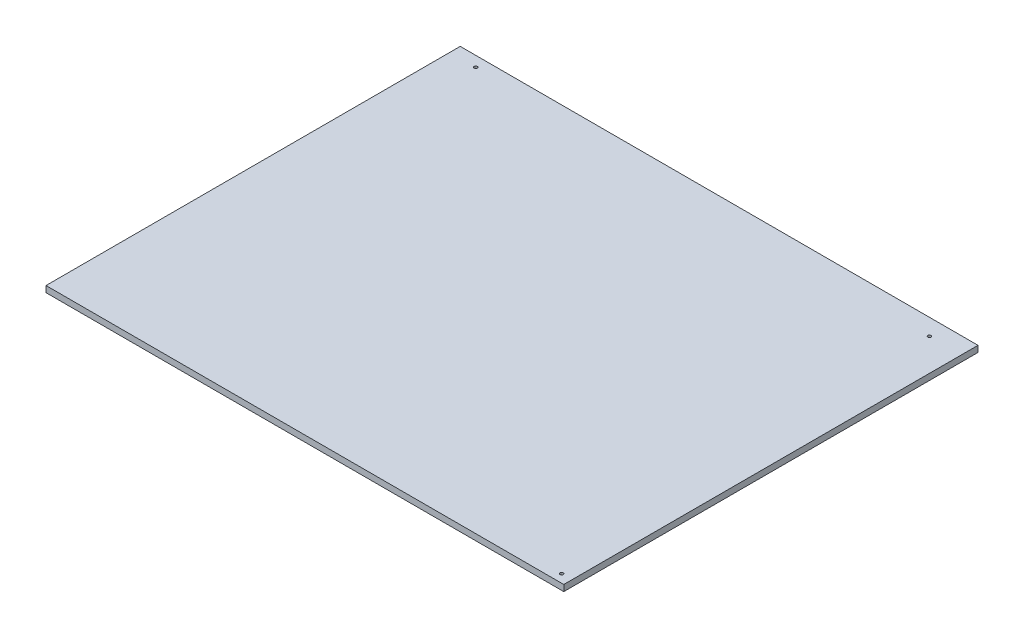
ISO-10303-21;
HEADER;
FILE_DESCRIPTION(('STEP AP214'),'2;1');
FILE_NAME('part.step','',(''),(''),'','','');
FILE_SCHEMA(('AUTOMOTIVE_DESIGN { 1 0 10303 214 1 1 1 1 }'));
ENDSEC;
DATA;
#1=APPLICATION_CONTEXT('core data for automotive mechanical design processes');
#2=APPLICATION_PROTOCOL_DEFINITION('international standard','automotive_design',2000,#1);
#3=PRODUCT_CONTEXT('',#1,'mechanical');
#4=PRODUCT('Part','Part','',(#3));
#5=PRODUCT_RELATED_PRODUCT_CATEGORY('part','',(#4));
#6=PRODUCT_DEFINITION_FORMATION('','',#4);
#7=PRODUCT_DEFINITION_CONTEXT('part definition',#1,'design');
#8=PRODUCT_DEFINITION('design','',#6,#7);
#9=PRODUCT_DEFINITION_SHAPE('','',#8);
#10=(LENGTH_UNIT() NAMED_UNIT(*) SI_UNIT(.MILLI.,.METRE.));
#11=(NAMED_UNIT(*) PLANE_ANGLE_UNIT() SI_UNIT($,.RADIAN.));
#12=(NAMED_UNIT(*) SI_UNIT($,.STERADIAN.) SOLID_ANGLE_UNIT());
#13=UNCERTAINTY_MEASURE_WITH_UNIT(LENGTH_MEASURE(1.E-05),#10,'distance_accuracy_value','');
#14=(GEOMETRIC_REPRESENTATION_CONTEXT(3) GLOBAL_UNCERTAINTY_ASSIGNED_CONTEXT((#13)) GLOBAL_UNIT_ASSIGNED_CONTEXT((#10,
#11,#12)) REPRESENTATION_CONTEXT('',''));
#15=CARTESIAN_POINT('',(0.,0.,0.));
#16=DIRECTION('',(0.,0.,1.));
#17=DIRECTION('',(1.,0.,0.));
#18=AXIS2_PLACEMENT_3D('',#15,#16,#17);
#19=CARTESIAN_POINT('',(0.,6.,0.));
#20=DIRECTION('',(0.,1.,0.));
#21=DIRECTION('',(0.,0.,1.));
#22=AXIS2_PLACEMENT_3D('',#19,#20,#21);
#23=PLANE('',#22);
#24=CARTESIAN_POINT('',(490.,6.,392.));
#25=DIRECTION('',(0.,1.,0.));
#26=DIRECTION('',(0.,0.,1.));
#27=AXIS2_PLACEMENT_3D('',#24,#25,#26);
#28=CIRCLE('',#27,1.50000000000002);
#29=CARTESIAN_POINT('',(490.,6.,393.5));
#30=VERTEX_POINT('',#29);
#31=EDGE_CURVE('E114',#30,#30,#28,.T.);
#32=ORIENTED_EDGE('',*,*,#31,.F.);
#33=EDGE_LOOP('',(#32));
#34=FACE_BOUND('',#33,.T.);
#35=DIRECTION('',(0.,0.,1.));
#36=VECTOR('',#35,1.);
#37=CARTESIAN_POINT('',(0.,6.,0.));
#38=LINE('',#37,#36);
#39=CARTESIAN_POINT('',(0.,6.,0.));
#40=VERTEX_POINT('',#39);
#41=CARTESIAN_POINT('',(0.,6.,400.));
#42=VERTEX_POINT('',#41);
#43=EDGE_CURVE('E84',#40,#42,#38,.T.);
#44=ORIENTED_EDGE('',*,*,#43,.T.);
#45=DIRECTION('',(1.,0.,0.));
#46=VECTOR('',#45,1.);
#47=CARTESIAN_POINT('',(0.,6.,400.));
#48=LINE('',#47,#46);
#49=CARTESIAN_POINT('',(500.,6.,400.));
#50=VERTEX_POINT('',#49);
#51=EDGE_CURVE('E79',#42,#50,#48,.T.);
#52=ORIENTED_EDGE('',*,*,#51,.T.);
#53=DIRECTION('',(0.,0.,-1.));
#54=VECTOR('',#53,1.);
#55=CARTESIAN_POINT('',(500.,6.,0.));
#56=LINE('',#55,#54);
#57=CARTESIAN_POINT('',(500.,6.,0.));
#58=VERTEX_POINT('',#57);
#59=EDGE_CURVE('E82',#50,#58,#56,.T.);
#60=ORIENTED_EDGE('',*,*,#59,.T.);
#61=DIRECTION('',(-1.,0.,0.));
#62=VECTOR('',#61,1.);
#63=CARTESIAN_POINT('',(0.,6.,0.));
#64=LINE('',#63,#62);
#65=EDGE_CURVE('E49',#58,#40,#64,.T.);
#66=ORIENTED_EDGE('',*,*,#65,.T.);
#67=EDGE_LOOP('',(#44,#52,#60,#66));
#68=FACE_BOUND('',#67,.T.);
#69=CARTESIAN_POINT('',(25.,6.,10.));
#70=DIRECTION('',(0.,1.,0.));
#71=DIRECTION('',(0.,0.,1.));
#72=AXIS2_PLACEMENT_3D('',#69,#70,#71);
#73=CIRCLE('',#72,1.52499999999999);
#74=CARTESIAN_POINT('',(25.,6.,11.525));
#75=VERTEX_POINT('',#74);
#76=EDGE_CURVE('E99',#75,#75,#73,.T.);
#77=ORIENTED_EDGE('',*,*,#76,.F.);
#78=EDGE_LOOP('',(#77));
#79=FACE_BOUND('',#78,.T.);
#80=CARTESIAN_POINT('',(469.,6.,16.));
#81=DIRECTION('',(0.,1.,0.));
#82=DIRECTION('',(0.,0.,1.));
#83=AXIS2_PLACEMENT_3D('',#80,#81,#82);
#84=CIRCLE('',#83,1.50000000000002);
#85=CARTESIAN_POINT('',(469.,6.,17.5));
#86=VERTEX_POINT('',#85);
#87=EDGE_CURVE('E120',#86,#86,#84,.T.);
#88=ORIENTED_EDGE('',*,*,#87,.F.);
#89=EDGE_LOOP('',(#88));
#90=FACE_BOUND('',#89,.T.);
#91=ADVANCED_FACE('F32',(#34,#68,#79,#90),#23,.T.);
#92=CARTESIAN_POINT('',(0.,0.,0.));
#93=DIRECTION('',(0.,1.,0.));
#94=DIRECTION('',(0.,0.,1.));
#95=AXIS2_PLACEMENT_3D('',#92,#93,#94);
#96=PLANE('',#95);
#97=DIRECTION('',(0.,0.,1.));
#98=VECTOR('',#97,1.);
#99=CARTESIAN_POINT('',(0.,0.,0.));
#100=LINE('',#99,#98);
#101=CARTESIAN_POINT('',(0.,0.,0.));
#102=VERTEX_POINT('',#101);
#103=CARTESIAN_POINT('',(0.,0.,400.));
#104=VERTEX_POINT('',#103);
#105=EDGE_CURVE('E96',#102,#104,#100,.T.);
#106=ORIENTED_EDGE('',*,*,#105,.F.);
#107=DIRECTION('',(-1.,0.,0.));
#108=VECTOR('',#107,1.);
#109=CARTESIAN_POINT('',(0.,0.,0.));
#110=LINE('',#109,#108);
#111=CARTESIAN_POINT('',(500.,0.,0.));
#112=VERTEX_POINT('',#111);
#113=EDGE_CURVE('E72',#112,#102,#110,.T.);
#114=ORIENTED_EDGE('',*,*,#113,.F.);
#115=DIRECTION('',(0.,0.,-1.));
#116=VECTOR('',#115,1.);
#117=CARTESIAN_POINT('',(500.,0.,0.));
#118=LINE('',#117,#116);
#119=CARTESIAN_POINT('',(500.,0.,400.));
#120=VERTEX_POINT('',#119);
#121=EDGE_CURVE('E66',#120,#112,#118,.T.);
#122=ORIENTED_EDGE('',*,*,#121,.F.);
#123=DIRECTION('',(1.,0.,0.));
#124=VECTOR('',#123,1.);
#125=CARTESIAN_POINT('',(0.,0.,400.));
#126=LINE('',#125,#124);
#127=EDGE_CURVE('E88',#104,#120,#126,.T.);
#128=ORIENTED_EDGE('',*,*,#127,.F.);
#129=EDGE_LOOP('',(#106,#114,#122,#128));
#130=FACE_BOUND('',#129,.T.);
#131=CARTESIAN_POINT('',(25.,0.,10.));
#132=DIRECTION('',(0.,1.,0.));
#133=DIRECTION('',(0.,0.,1.));
#134=AXIS2_PLACEMENT_3D('',#131,#132,#133);
#135=CIRCLE('',#134,1.52499999999999);
#136=CARTESIAN_POINT('',(25.,0.,11.525));
#137=VERTEX_POINT('',#136);
#138=EDGE_CURVE('E111',#137,#137,#135,.T.);
#139=ORIENTED_EDGE('',*,*,#138,.T.);
#140=EDGE_LOOP('',(#139));
#141=FACE_BOUND('',#140,.T.);
#142=CARTESIAN_POINT('',(490.,0.,392.));
#143=DIRECTION('',(0.,1.,0.));
#144=DIRECTION('',(0.,0.,1.));
#145=AXIS2_PLACEMENT_3D('',#142,#143,#144);
#146=CIRCLE('',#145,1.50000000000002);
#147=CARTESIAN_POINT('',(490.,0.,393.5));
#148=VERTEX_POINT('',#147);
#149=EDGE_CURVE('E117',#148,#148,#146,.T.);
#150=ORIENTED_EDGE('',*,*,#149,.T.);
#151=EDGE_LOOP('',(#150));
#152=FACE_BOUND('',#151,.T.);
#153=CARTESIAN_POINT('',(469.,0.,16.));
#154=DIRECTION('',(0.,1.,0.));
#155=DIRECTION('',(0.,0.,1.));
#156=AXIS2_PLACEMENT_3D('',#153,#154,#155);
#157=CIRCLE('',#156,1.50000000000002);
#158=CARTESIAN_POINT('',(469.,0.,17.5));
#159=VERTEX_POINT('',#158);
#160=EDGE_CURVE('E123',#159,#159,#157,.T.);
#161=ORIENTED_EDGE('',*,*,#160,.T.);
#162=EDGE_LOOP('',(#161));
#163=FACE_BOUND('',#162,.T.);
#164=ADVANCED_FACE('F107',(#130,#141,#152,#163),#96,.F.);
#165=CARTESIAN_POINT('',(0.,6.,0.));
#166=DIRECTION('',(1.,0.,0.));
#167=DIRECTION('',(0.,0.,-1.));
#168=AXIS2_PLACEMENT_3D('',#165,#166,#167);
#169=PLANE('',#168);
#170=ORIENTED_EDGE('',*,*,#105,.T.);
#171=DIRECTION('',(0.,-1.,0.));
#172=VECTOR('',#171,1.);
#173=CARTESIAN_POINT('',(0.,6.,400.));
#174=LINE('',#173,#172);
#175=EDGE_CURVE('E11',#42,#104,#174,.T.);
#176=ORIENTED_EDGE('',*,*,#175,.F.);
#177=ORIENTED_EDGE('',*,*,#43,.F.);
#178=DIRECTION('',(0.,-1.,0.));
#179=VECTOR('',#178,1.);
#180=CARTESIAN_POINT('',(0.,6.,0.));
#181=LINE('',#180,#179);
#182=EDGE_CURVE('E92',#40,#102,#181,.T.);
#183=ORIENTED_EDGE('',*,*,#182,.T.);
#184=EDGE_LOOP('',(#170,#176,#177,#183));
#185=FACE_BOUND('',#184,.T.);
#186=ADVANCED_FACE('F34',(#185),#169,.F.);
#187=CARTESIAN_POINT('',(0.,6.,400.));
#188=DIRECTION('',(0.,0.,-1.));
#189=DIRECTION('',(-1.,0.,0.));
#190=AXIS2_PLACEMENT_3D('',#187,#188,#189);
#191=PLANE('',#190);
#192=ORIENTED_EDGE('',*,*,#127,.T.);
#193=DIRECTION('',(0.,-1.,0.));
#194=VECTOR('',#193,1.);
#195=CARTESIAN_POINT('',(500.,6.,400.));
#196=LINE('',#195,#194);
#197=EDGE_CURVE('E41',#50,#120,#196,.T.);
#198=ORIENTED_EDGE('',*,*,#197,.F.);
#199=ORIENTED_EDGE('',*,*,#51,.F.);
#200=ORIENTED_EDGE('',*,*,#175,.T.);
#201=EDGE_LOOP('',(#192,#198,#199,#200));
#202=FACE_BOUND('',#201,.T.);
#203=ADVANCED_FACE('F87',(#202),#191,.F.);
#204=CARTESIAN_POINT('',(500.,6.,0.));
#205=DIRECTION('',(-1.,0.,0.));
#206=DIRECTION('',(0.,0.,1.));
#207=AXIS2_PLACEMENT_3D('',#204,#205,#206);
#208=PLANE('',#207);
#209=ORIENTED_EDGE('',*,*,#121,.T.);
#210=DIRECTION('',(0.,-1.,0.));
#211=VECTOR('',#210,1.);
#212=CARTESIAN_POINT('',(500.,6.,0.));
#213=LINE('',#212,#211);
#214=EDGE_CURVE('E89',#58,#112,#213,.T.);
#215=ORIENTED_EDGE('',*,*,#214,.F.);
#216=ORIENTED_EDGE('',*,*,#59,.F.);
#217=ORIENTED_EDGE('',*,*,#197,.T.);
#218=EDGE_LOOP('',(#209,#215,#216,#217));
#219=FACE_BOUND('',#218,.T.);
#220=ADVANCED_FACE('F90',(#219),#208,.F.);
#221=CARTESIAN_POINT('',(0.,6.,0.));
#222=DIRECTION('',(0.,0.,1.));
#223=DIRECTION('',(1.,0.,0.));
#224=AXIS2_PLACEMENT_3D('',#221,#222,#223);
#225=PLANE('',#224);
#226=ORIENTED_EDGE('',*,*,#113,.T.);
#227=ORIENTED_EDGE('',*,*,#182,.F.);
#228=ORIENTED_EDGE('',*,*,#65,.F.);
#229=ORIENTED_EDGE('',*,*,#214,.T.);
#230=EDGE_LOOP('',(#226,#227,#228,#229));
#231=FACE_BOUND('',#230,.T.);
#232=ADVANCED_FACE('F104',(#231),#225,.F.);
#233=CARTESIAN_POINT('',(25.,6.,10.));
#234=DIRECTION('',(0.,-1.,0.));
#235=DIRECTION('',(0.,0.,-1.));
#236=AXIS2_PLACEMENT_3D('',#233,#234,#235);
#237=CYLINDRICAL_SURFACE('',#236,1.52499999999999);
#238=ORIENTED_EDGE('',*,*,#76,.T.);
#239=EDGE_LOOP('',(#238));
#240=FACE_BOUND('',#239,.T.);
#241=ORIENTED_EDGE('',*,*,#138,.F.);
#242=EDGE_LOOP('',(#241));
#243=FACE_BOUND('',#242,.T.);
#244=ADVANCED_FACE('F141',(#240,#243),#237,.F.);
#245=CARTESIAN_POINT('',(490.,6.,392.));
#246=DIRECTION('',(0.,-1.,0.));
#247=DIRECTION('',(0.,0.,-1.));
#248=AXIS2_PLACEMENT_3D('',#245,#246,#247);
#249=CYLINDRICAL_SURFACE('',#248,1.50000000000002);
#250=ORIENTED_EDGE('',*,*,#31,.T.);
#251=EDGE_LOOP('',(#250));
#252=FACE_BOUND('',#251,.T.);
#253=ORIENTED_EDGE('',*,*,#149,.F.);
#254=EDGE_LOOP('',(#253));
#255=FACE_BOUND('',#254,.T.);
#256=ADVANCED_FACE('F187',(#252,#255),#249,.F.);
#257=CARTESIAN_POINT('',(469.,6.,16.));
#258=DIRECTION('',(0.,-1.,0.));
#259=DIRECTION('',(0.,0.,-1.));
#260=AXIS2_PLACEMENT_3D('',#257,#258,#259);
#261=CYLINDRICAL_SURFACE('',#260,1.50000000000002);
#262=ORIENTED_EDGE('',*,*,#87,.T.);
#263=EDGE_LOOP('',(#262));
#264=FACE_BOUND('',#263,.T.);
#265=ORIENTED_EDGE('',*,*,#160,.F.);
#266=EDGE_LOOP('',(#265));
#267=FACE_BOUND('',#266,.T.);
#268=ADVANCED_FACE('F129',(#264,#267),#261,.F.);
#269=CLOSED_SHELL('',(#91,#164,#186,#203,#220,#232,#244,#256,#268));
#270=MANIFOLD_SOLID_BREP('B2',#269);
#271=ADVANCED_BREP_SHAPE_REPRESENTATION('',(#18,#270),#14);
#272=SHAPE_DEFINITION_REPRESENTATION(#9,#271);
ENDSEC;
END-ISO-10303-21;
